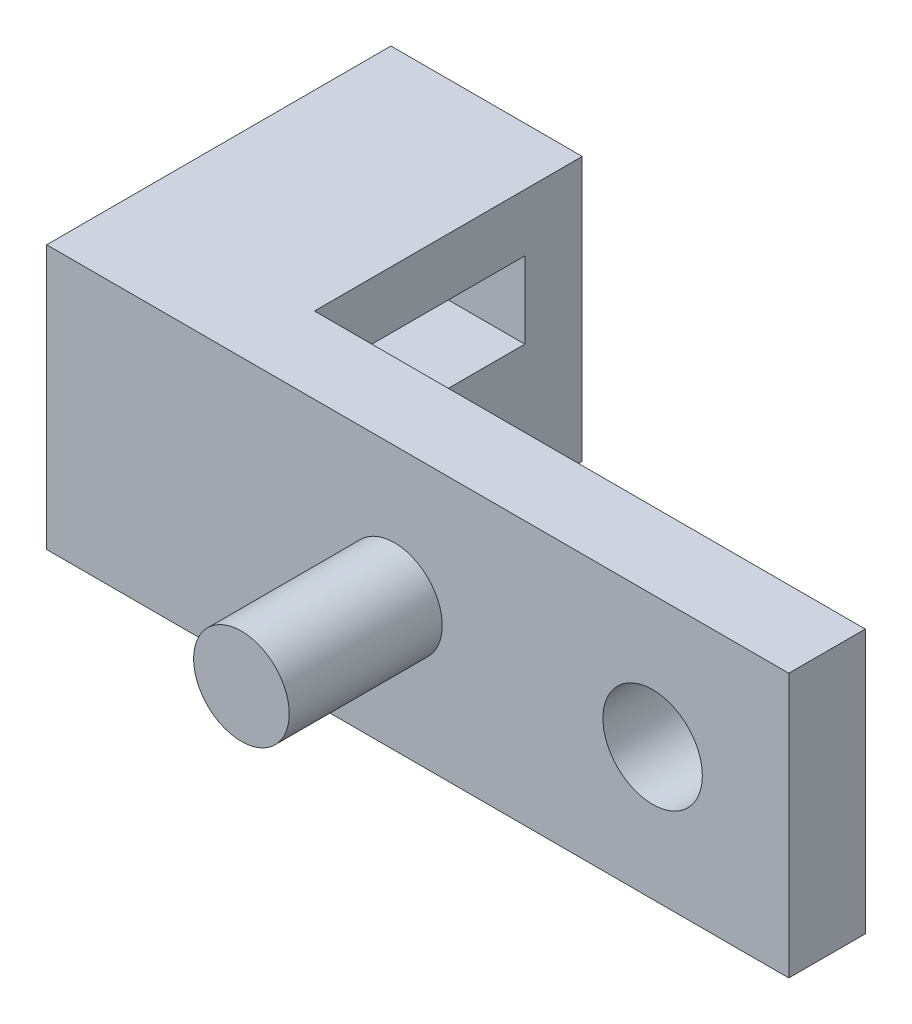
ISO-10303-21;
HEADER;
FILE_DESCRIPTION(('STEP AP214'),'2;1');
FILE_NAME('part.step','',(''),(''),'','','');
FILE_SCHEMA(('AUTOMOTIVE_DESIGN { 1 0 10303 214 1 1 1 1 }'));
ENDSEC;
DATA;
#1=APPLICATION_CONTEXT('core data for automotive mechanical design processes');
#2=APPLICATION_PROTOCOL_DEFINITION('international standard','automotive_design',2000,#1);
#3=PRODUCT_CONTEXT('',#1,'mechanical');
#4=PRODUCT('Part','Part','',(#3));
#5=PRODUCT_RELATED_PRODUCT_CATEGORY('part','',(#4));
#6=PRODUCT_DEFINITION_FORMATION('','',#4);
#7=PRODUCT_DEFINITION_CONTEXT('part definition',#1,'design');
#8=PRODUCT_DEFINITION('design','',#6,#7);
#9=PRODUCT_DEFINITION_SHAPE('','',#8);
#10=(LENGTH_UNIT() NAMED_UNIT(*) SI_UNIT(.MILLI.,.METRE.));
#11=(NAMED_UNIT(*) PLANE_ANGLE_UNIT() SI_UNIT($,.RADIAN.));
#12=(NAMED_UNIT(*) SI_UNIT($,.STERADIAN.) SOLID_ANGLE_UNIT());
#13=UNCERTAINTY_MEASURE_WITH_UNIT(LENGTH_MEASURE(1.E-05),#10,'distance_accuracy_value','');
#14=(GEOMETRIC_REPRESENTATION_CONTEXT(3) GLOBAL_UNCERTAINTY_ASSIGNED_CONTEXT((#13)) GLOBAL_UNIT_ASSIGNED_CONTEXT((#10,
#11,#12)) REPRESENTATION_CONTEXT('',''));
#15=CARTESIAN_POINT('',(0.,0.,0.));
#16=DIRECTION('',(0.,0.,1.));
#17=DIRECTION('',(1.,0.,0.));
#18=AXIS2_PLACEMENT_3D('',#15,#16,#17);
#19=CARTESIAN_POINT('',(154.749006663672,6.9,21.0054991539763));
#20=DIRECTION('',(0.,0.,-1.));
#21=DIRECTION('',(-1.,0.,0.));
#22=AXIS2_PLACEMENT_3D('',#19,#20,#21);
#23=PLANE('',#22);
#24=DIRECTION('',(1.,0.,0.));
#25=VECTOR('',#24,1.);
#26=CARTESIAN_POINT('',(154.749006663672,0.,21.0054991539763));
#27=LINE('',#26,#25);
#28=CARTESIAN_POINT('',(135.349006663672,0.,21.0054991539763));
#29=VERTEX_POINT('',#28);
#30=CARTESIAN_POINT('',(154.749006663672,0.,21.0054991539763));
#31=VERTEX_POINT('',#30);
#32=EDGE_CURVE('E160',#29,#31,#27,.T.);
#33=ORIENTED_EDGE('',*,*,#32,.T.);
#34=DIRECTION('',(0.,-1.,0.));
#35=VECTOR('',#34,1.);
#36=CARTESIAN_POINT('',(154.749006663672,6.9,21.0054991539763));
#37=LINE('',#36,#35);
#38=CARTESIAN_POINT('',(154.749006663672,6.9,21.0054991539763));
#39=VERTEX_POINT('',#38);
#40=EDGE_CURVE('E170',#39,#31,#37,.T.);
#41=ORIENTED_EDGE('',*,*,#40,.F.);
#42=DIRECTION('',(1.,0.,0.));
#43=VECTOR('',#42,1.);
#44=CARTESIAN_POINT('',(154.749006663672,6.9,21.0054991539763));
#45=LINE('',#44,#43);
#46=CARTESIAN_POINT('',(135.349006663672,6.9,21.0054991539763));
#47=VERTEX_POINT('',#46);
#48=EDGE_CURVE('E168',#47,#39,#45,.T.);
#49=ORIENTED_EDGE('',*,*,#48,.F.);
#50=DIRECTION('',(0.,-1.,0.));
#51=VECTOR('',#50,1.);
#52=CARTESIAN_POINT('',(135.349006663672,6.9,21.0054991539763));
#53=LINE('',#52,#51);
#54=EDGE_CURVE('E184',#47,#29,#53,.T.);
#55=ORIENTED_EDGE('',*,*,#54,.T.);
#56=EDGE_LOOP('',(#33,#41,#49,#55));
#57=FACE_BOUND('',#56,.T.);
#58=CARTESIAN_POINT('',(151.189006663672,3.45,21.0054991539764));
#59=DIRECTION('',(0.,0.,1.));
#60=DIRECTION('',(1.,0.,0.));
#61=AXIS2_PLACEMENT_3D('',#58,#59,#60);
#62=CIRCLE('',#61,1.30000000000001);
#63=CARTESIAN_POINT('',(152.489006663672,3.45,21.0054991539764));
#64=VERTEX_POINT('',#63);
#65=EDGE_CURVE('E149',#64,#64,#62,.T.);
#66=ORIENTED_EDGE('',*,*,#65,.F.);
#67=EDGE_LOOP('',(#66));
#68=FACE_BOUND('',#67,.T.);
#69=CARTESIAN_POINT('',(144.439006663672,3.45,21.0054991539763));
#70=DIRECTION('',(0.,0.,-1.));
#71=DIRECTION('',(-1.,0.,0.));
#72=AXIS2_PLACEMENT_3D('',#69,#70,#71);
#73=CIRCLE('',#72,1.25000000000001);
#74=CARTESIAN_POINT('',(143.189006663672,3.45,21.0054991539763));
#75=VERTEX_POINT('',#74);
#76=EDGE_CURVE('E11',#75,#75,#73,.F.);
#77=ORIENTED_EDGE('',*,*,#76,.F.);
#78=EDGE_LOOP('',(#77));
#79=FACE_BOUND('',#78,.T.);
#80=ADVANCED_FACE('F33',(#57,#68,#79),#23,.F.);
#81=CARTESIAN_POINT('',(154.749006663672,6.9,19.0054991539763));
#82=DIRECTION('',(-1.,0.,0.));
#83=DIRECTION('',(0.,0.,1.));
#84=AXIS2_PLACEMENT_3D('',#81,#82,#83);
#85=PLANE('',#84);
#86=DIRECTION('',(0.,0.,-1.));
#87=VECTOR('',#86,1.);
#88=CARTESIAN_POINT('',(154.749006663672,0.,19.0054991539763));
#89=LINE('',#88,#87);
#90=CARTESIAN_POINT('',(154.749006663672,0.,19.0054991539763));
#91=VERTEX_POINT('',#90);
#92=EDGE_CURVE('E155',#31,#91,#89,.T.);
#93=ORIENTED_EDGE('',*,*,#92,.T.);
#94=DIRECTION('',(0.,-1.,0.));
#95=VECTOR('',#94,1.);
#96=CARTESIAN_POINT('',(154.749006663672,6.9,19.0054991539763));
#97=LINE('',#96,#95);
#98=CARTESIAN_POINT('',(154.749006663672,6.9,19.0054991539763));
#99=VERTEX_POINT('',#98);
#100=EDGE_CURVE('E41',#99,#91,#97,.T.);
#101=ORIENTED_EDGE('',*,*,#100,.F.);
#102=DIRECTION('',(0.,0.,-1.));
#103=VECTOR('',#102,1.);
#104=CARTESIAN_POINT('',(154.749006663672,6.9,19.0054991539763));
#105=LINE('',#104,#103);
#106=EDGE_CURVE('E156',#39,#99,#105,.T.);
#107=ORIENTED_EDGE('',*,*,#106,.F.);
#108=ORIENTED_EDGE('',*,*,#40,.T.);
#109=EDGE_LOOP('',(#93,#101,#107,#108));
#110=FACE_BOUND('',#109,.T.);
#111=ADVANCED_FACE('F35',(#110),#85,.F.);
#112=CARTESIAN_POINT('',(140.349006663672,6.9,19.0054991539763));
#113=DIRECTION('',(0.,0.,1.));
#114=DIRECTION('',(1.,0.,0.));
#115=AXIS2_PLACEMENT_3D('',#112,#113,#114);
#116=PLANE('',#115);
#117=CARTESIAN_POINT('',(151.189006663672,3.45,19.0054991539763));
#118=DIRECTION('',(0.,0.,1.));
#119=DIRECTION('',(1.,0.,0.));
#120=AXIS2_PLACEMENT_3D('',#117,#118,#119);
#121=CIRCLE('',#120,1.30000000000001);
#122=CARTESIAN_POINT('',(152.489006663672,3.45,19.0054991539763));
#123=VERTEX_POINT('',#122);
#124=EDGE_CURVE('E152',#123,#123,#121,.T.);
#125=ORIENTED_EDGE('',*,*,#124,.T.);
#126=EDGE_LOOP('',(#125));
#127=FACE_BOUND('',#126,.T.);
#128=DIRECTION('',(-1.,0.,0.));
#129=VECTOR('',#128,1.);
#130=CARTESIAN_POINT('',(140.349006663672,0.,19.0054991539763));
#131=LINE('',#130,#129);
#132=CARTESIAN_POINT('',(140.349006663672,0.,19.0054991539763));
#133=VERTEX_POINT('',#132);
#134=EDGE_CURVE('E173',#91,#133,#131,.T.);
#135=ORIENTED_EDGE('',*,*,#134,.T.);
#136=DIRECTION('',(0.,-1.,0.));
#137=VECTOR('',#136,1.);
#138=CARTESIAN_POINT('',(140.349006663672,6.9,19.0054991539763));
#139=LINE('',#138,#137);
#140=CARTESIAN_POINT('',(140.349006663672,6.9,19.0054991539763));
#141=VERTEX_POINT('',#140);
#142=EDGE_CURVE('E193',#141,#133,#139,.T.);
#143=ORIENTED_EDGE('',*,*,#142,.F.);
#144=DIRECTION('',(-1.,0.,0.));
#145=VECTOR('',#144,1.);
#146=CARTESIAN_POINT('',(140.349006663672,6.9,19.0054991539763));
#147=LINE('',#146,#145);
#148=EDGE_CURVE('E159',#99,#141,#147,.T.);
#149=ORIENTED_EDGE('',*,*,#148,.F.);
#150=ORIENTED_EDGE('',*,*,#100,.T.);
#151=EDGE_LOOP('',(#135,#143,#149,#150));
#152=FACE_BOUND('',#151,.T.);
#153=ADVANCED_FACE('F198',(#127,#152),#116,.F.);
#154=CARTESIAN_POINT('',(140.349006663672,6.9,12.0054991539763));
#155=DIRECTION('',(-1.,0.,0.));
#156=DIRECTION('',(0.,0.,1.));
#157=AXIS2_PLACEMENT_3D('',#154,#155,#156);
#158=PLANE('',#157);
#159=DIRECTION('',(0.,0.,-1.));
#160=VECTOR('',#159,1.);
#161=CARTESIAN_POINT('',(140.349006663672,3.4,17.5054991539763));
#162=LINE('',#161,#160);
#163=CARTESIAN_POINT('',(140.349006663672,3.4,17.5054991539763));
#164=VERTEX_POINT('',#163);
#165=CARTESIAN_POINT('',(140.349006663672,3.4,13.5054991539763));
#166=VERTEX_POINT('',#165);
#167=EDGE_CURVE('E137',#164,#166,#162,.T.);
#168=ORIENTED_EDGE('',*,*,#167,.F.);
#169=DIRECTION('',(0.,-1.,0.));
#170=VECTOR('',#169,1.);
#171=CARTESIAN_POINT('',(140.349006663672,3.4,17.5054991539763));
#172=LINE('',#171,#170);
#173=CARTESIAN_POINT('',(140.349006663672,5.4,17.5054991539763));
#174=VERTEX_POINT('',#173);
#175=EDGE_CURVE('E48',#174,#164,#172,.T.);
#176=ORIENTED_EDGE('',*,*,#175,.F.);
#177=DIRECTION('',(0.,0.,1.));
#178=VECTOR('',#177,1.);
#179=CARTESIAN_POINT('',(140.349006663672,5.4,17.5054991539763));
#180=LINE('',#179,#178);
#181=CARTESIAN_POINT('',(140.349006663672,5.4,13.5054991539763));
#182=VERTEX_POINT('',#181);
#183=EDGE_CURVE('E128',#182,#174,#180,.T.);
#184=ORIENTED_EDGE('',*,*,#183,.F.);
#185=DIRECTION('',(0.,1.,0.));
#186=VECTOR('',#185,1.);
#187=CARTESIAN_POINT('',(140.349006663672,3.4,13.5054991539763));
#188=LINE('',#187,#186);
#189=EDGE_CURVE('E131',#166,#182,#188,.T.);
#190=ORIENTED_EDGE('',*,*,#189,.F.);
#191=EDGE_LOOP('',(#168,#176,#184,#190));
#192=FACE_BOUND('',#191,.T.);
#193=DIRECTION('',(0.,0.,-1.));
#194=VECTOR('',#193,1.);
#195=CARTESIAN_POINT('',(140.349006663672,0.,12.0054991539763));
#196=LINE('',#195,#194);
#197=CARTESIAN_POINT('',(140.349006663672,0.,12.0054991539763));
#198=VERTEX_POINT('',#197);
#199=EDGE_CURVE('E175',#133,#198,#196,.T.);
#200=ORIENTED_EDGE('',*,*,#199,.T.);
#201=DIRECTION('',(0.,-1.,0.));
#202=VECTOR('',#201,1.);
#203=CARTESIAN_POINT('',(140.349006663672,6.9,12.0054991539763));
#204=LINE('',#203,#202);
#205=CARTESIAN_POINT('',(140.349006663672,6.9,12.0054991539763));
#206=VERTEX_POINT('',#205);
#207=EDGE_CURVE('E190',#206,#198,#204,.T.);
#208=ORIENTED_EDGE('',*,*,#207,.F.);
#209=DIRECTION('',(0.,0.,-1.));
#210=VECTOR('',#209,1.);
#211=CARTESIAN_POINT('',(140.349006663672,6.9,12.0054991539763));
#212=LINE('',#211,#210);
#213=EDGE_CURVE('E162',#141,#206,#212,.T.);
#214=ORIENTED_EDGE('',*,*,#213,.F.);
#215=ORIENTED_EDGE('',*,*,#142,.T.);
#216=EDGE_LOOP('',(#200,#208,#214,#215));
#217=FACE_BOUND('',#216,.T.);
#218=ADVANCED_FACE('F212',(#192,#217),#158,.F.);
#219=CARTESIAN_POINT('',(135.349006663672,6.9,12.0054991539763));
#220=DIRECTION('',(0.,0.,1.));
#221=DIRECTION('',(1.,0.,0.));
#222=AXIS2_PLACEMENT_3D('',#219,#220,#221);
#223=PLANE('',#222);
#224=DIRECTION('',(-1.,0.,0.));
#225=VECTOR('',#224,1.);
#226=CARTESIAN_POINT('',(135.349006663672,0.,12.0054991539763));
#227=LINE('',#226,#225);
#228=CARTESIAN_POINT('',(135.349006663672,0.,12.0054991539763));
#229=VERTEX_POINT('',#228);
#230=EDGE_CURVE('E177',#198,#229,#227,.T.);
#231=ORIENTED_EDGE('',*,*,#230,.T.);
#232=DIRECTION('',(0.,-1.,0.));
#233=VECTOR('',#232,1.);
#234=CARTESIAN_POINT('',(135.349006663672,6.9,12.0054991539763));
#235=LINE('',#234,#233);
#236=CARTESIAN_POINT('',(135.349006663672,6.9,12.0054991539763));
#237=VERTEX_POINT('',#236);
#238=EDGE_CURVE('E187',#237,#229,#235,.T.);
#239=ORIENTED_EDGE('',*,*,#238,.F.);
#240=DIRECTION('',(-1.,0.,0.));
#241=VECTOR('',#240,1.);
#242=CARTESIAN_POINT('',(135.349006663672,6.9,12.0054991539763));
#243=LINE('',#242,#241);
#244=EDGE_CURVE('E164',#206,#237,#243,.T.);
#245=ORIENTED_EDGE('',*,*,#244,.F.);
#246=ORIENTED_EDGE('',*,*,#207,.T.);
#247=EDGE_LOOP('',(#231,#239,#245,#246));
#248=FACE_BOUND('',#247,.T.);
#249=ADVANCED_FACE('F216',(#248),#223,.F.);
#250=CARTESIAN_POINT('',(135.349006663672,6.9,21.0054991539763));
#251=DIRECTION('',(1.,0.,0.));
#252=DIRECTION('',(0.,0.,-1.));
#253=AXIS2_PLACEMENT_3D('',#250,#251,#252);
#254=PLANE('',#253);
#255=DIRECTION('',(0.,0.,1.));
#256=VECTOR('',#255,1.);
#257=CARTESIAN_POINT('',(135.349006663672,5.4,17.5054991539763));
#258=LINE('',#257,#256);
#259=CARTESIAN_POINT('',(135.349006663672,5.4,13.5054991539763));
#260=VERTEX_POINT('',#259);
#261=CARTESIAN_POINT('',(135.349006663672,5.4,17.5054991539763));
#262=VERTEX_POINT('',#261);
#263=EDGE_CURVE('E118',#260,#262,#258,.T.);
#264=ORIENTED_EDGE('',*,*,#263,.T.);
#265=DIRECTION('',(0.,-1.,0.));
#266=VECTOR('',#265,1.);
#267=CARTESIAN_POINT('',(135.349006663672,3.4,17.5054991539763));
#268=LINE('',#267,#266);
#269=CARTESIAN_POINT('',(135.349006663672,3.4,17.5054991539763));
#270=VERTEX_POINT('',#269);
#271=EDGE_CURVE('E112',#262,#270,#268,.T.);
#272=ORIENTED_EDGE('',*,*,#271,.T.);
#273=DIRECTION('',(0.,0.,-1.));
#274=VECTOR('',#273,1.);
#275=CARTESIAN_POINT('',(135.349006663672,3.4,17.5054991539763));
#276=LINE('',#275,#274);
#277=CARTESIAN_POINT('',(135.349006663672,3.4,13.5054991539763));
#278=VERTEX_POINT('',#277);
#279=EDGE_CURVE('E121',#270,#278,#276,.T.);
#280=ORIENTED_EDGE('',*,*,#279,.T.);
#281=DIRECTION('',(0.,1.,0.));
#282=VECTOR('',#281,1.);
#283=CARTESIAN_POINT('',(135.349006663672,3.4,13.5054991539763));
#284=LINE('',#283,#282);
#285=EDGE_CURVE('E56',#278,#260,#284,.T.);
#286=ORIENTED_EDGE('',*,*,#285,.T.);
#287=EDGE_LOOP('',(#264,#272,#280,#286));
#288=FACE_BOUND('',#287,.T.);
#289=DIRECTION('',(0.,0.,1.));
#290=VECTOR('',#289,1.);
#291=CARTESIAN_POINT('',(135.349006663672,0.,21.0054991539763));
#292=LINE('',#291,#290);
#293=EDGE_CURVE('E179',#229,#29,#292,.T.);
#294=ORIENTED_EDGE('',*,*,#293,.T.);
#295=ORIENTED_EDGE('',*,*,#54,.F.);
#296=DIRECTION('',(0.,0.,1.));
#297=VECTOR('',#296,1.);
#298=CARTESIAN_POINT('',(135.349006663672,6.9,21.0054991539763));
#299=LINE('',#298,#297);
#300=EDGE_CURVE('E166',#237,#47,#299,.T.);
#301=ORIENTED_EDGE('',*,*,#300,.F.);
#302=ORIENTED_EDGE('',*,*,#238,.T.);
#303=EDGE_LOOP('',(#294,#295,#301,#302));
#304=FACE_BOUND('',#303,.T.);
#305=ADVANCED_FACE('F125',(#288,#304),#254,.F.);
#306=CARTESIAN_POINT('',(0.,6.9,0.));
#307=DIRECTION('',(0.,-1.,0.));
#308=DIRECTION('',(0.,0.,-1.));
#309=AXIS2_PLACEMENT_3D('',#306,#307,#308);
#310=PLANE('',#309);
#311=ORIENTED_EDGE('',*,*,#106,.T.);
#312=ORIENTED_EDGE('',*,*,#148,.T.);
#313=ORIENTED_EDGE('',*,*,#213,.T.);
#314=ORIENTED_EDGE('',*,*,#244,.T.);
#315=ORIENTED_EDGE('',*,*,#300,.T.);
#316=ORIENTED_EDGE('',*,*,#48,.T.);
#317=EDGE_LOOP('',(#311,#312,#313,#314,#315,#316));
#318=FACE_BOUND('',#317,.T.);
#319=ADVANCED_FACE('F220',(#318),#310,.F.);
#320=CARTESIAN_POINT('',(0.,0.,0.));
#321=DIRECTION('',(0.,-1.,0.));
#322=DIRECTION('',(0.,0.,-1.));
#323=AXIS2_PLACEMENT_3D('',#320,#321,#322);
#324=PLANE('',#323);
#325=ORIENTED_EDGE('',*,*,#92,.F.);
#326=ORIENTED_EDGE('',*,*,#32,.F.);
#327=ORIENTED_EDGE('',*,*,#293,.F.);
#328=ORIENTED_EDGE('',*,*,#230,.F.);
#329=ORIENTED_EDGE('',*,*,#199,.F.);
#330=ORIENTED_EDGE('',*,*,#134,.F.);
#331=EDGE_LOOP('',(#325,#326,#327,#328,#329,#330));
#332=FACE_BOUND('',#331,.T.);
#333=ADVANCED_FACE('F206',(#332),#324,.T.);
#334=CARTESIAN_POINT('',(151.189006663672,3.45,12.0054991539763));
#335=DIRECTION('',(0.,0.,1.));
#336=DIRECTION('',(1.,0.,0.));
#337=AXIS2_PLACEMENT_3D('',#334,#335,#336);
#338=CYLINDRICAL_SURFACE('',#337,1.30000000000001);
#339=ORIENTED_EDGE('',*,*,#65,.T.);
#340=EDGE_LOOP('',(#339));
#341=FACE_BOUND('',#340,.T.);
#342=ORIENTED_EDGE('',*,*,#124,.F.);
#343=EDGE_LOOP('',(#342));
#344=FACE_BOUND('',#343,.T.);
#345=ADVANCED_FACE('F240',(#341,#344),#338,.F.);
#346=CARTESIAN_POINT('',(144.439006663672,3.45,25.0054991539764));
#347=DIRECTION('',(0.,0.,-1.));
#348=DIRECTION('',(-1.,0.,0.));
#349=AXIS2_PLACEMENT_3D('',#346,#347,#348);
#350=CYLINDRICAL_SURFACE('',#349,1.25000000000001);
#351=CARTESIAN_POINT('',(144.439006663672,3.45,25.0054991539764));
#352=DIRECTION('',(0.,0.,1.));
#353=DIRECTION('',(1.,0.,0.));
#354=AXIS2_PLACEMENT_3D('',#351,#352,#353);
#355=CIRCLE('',#354,1.25000000000001);
#356=CARTESIAN_POINT('',(145.689006663672,3.45,25.0054991539764));
#357=VERTEX_POINT('',#356);
#358=EDGE_CURVE('E143',#357,#357,#355,.T.);
#359=ORIENTED_EDGE('',*,*,#358,.F.);
#360=EDGE_LOOP('',(#359));
#361=FACE_BOUND('',#360,.T.);
#362=ORIENTED_EDGE('',*,*,#76,.T.);
#363=EDGE_LOOP('',(#362));
#364=FACE_BOUND('',#363,.T.);
#365=ADVANCED_FACE('F244',(#361,#364),#350,.T.);
#366=CARTESIAN_POINT('',(144.439006663672,3.45,25.0054991539764));
#367=DIRECTION('',(0.,0.,1.));
#368=DIRECTION('',(1.,0.,0.));
#369=AXIS2_PLACEMENT_3D('',#366,#367,#368);
#370=PLANE('',#369);
#371=ORIENTED_EDGE('',*,*,#358,.T.);
#372=EDGE_LOOP('',(#371));
#373=FACE_BOUND('',#372,.T.);
#374=ADVANCED_FACE('F248',(#373),#370,.T.);
#375=CARTESIAN_POINT('',(135.349006663672,3.4,17.5054991539763));
#376=DIRECTION('',(0.,0.,1.));
#377=DIRECTION('',(1.,0.,0.));
#378=AXIS2_PLACEMENT_3D('',#375,#376,#377);
#379=PLANE('',#378);
#380=ORIENTED_EDGE('',*,*,#175,.T.);
#381=DIRECTION('',(1.,0.,0.));
#382=VECTOR('',#381,1.);
#383=CARTESIAN_POINT('',(135.349006663672,3.4,17.5054991539763));
#384=LINE('',#383,#382);
#385=EDGE_CURVE('E108',#270,#164,#384,.T.);
#386=ORIENTED_EDGE('',*,*,#385,.F.);
#387=ORIENTED_EDGE('',*,*,#271,.F.);
#388=DIRECTION('',(1.,0.,0.));
#389=VECTOR('',#388,1.);
#390=CARTESIAN_POINT('',(135.349006663672,5.4,17.5054991539763));
#391=LINE('',#390,#389);
#392=EDGE_CURVE('E141',#262,#174,#391,.T.);
#393=ORIENTED_EDGE('',*,*,#392,.T.);
#394=EDGE_LOOP('',(#380,#386,#387,#393));
#395=FACE_BOUND('',#394,.T.);
#396=ADVANCED_FACE('F110',(#395),#379,.F.);
#397=CARTESIAN_POINT('',(135.349006663672,5.4,17.5054991539763));
#398=DIRECTION('',(0.,1.,0.));
#399=DIRECTION('',(0.,0.,1.));
#400=AXIS2_PLACEMENT_3D('',#397,#398,#399);
#401=PLANE('',#400);
#402=ORIENTED_EDGE('',*,*,#183,.T.);
#403=ORIENTED_EDGE('',*,*,#392,.F.);
#404=ORIENTED_EDGE('',*,*,#263,.F.);
#405=DIRECTION('',(1.,0.,0.));
#406=VECTOR('',#405,1.);
#407=CARTESIAN_POINT('',(135.349006663672,5.4,13.5054991539763));
#408=LINE('',#407,#406);
#409=EDGE_CURVE('E144',#260,#182,#408,.T.);
#410=ORIENTED_EDGE('',*,*,#409,.T.);
#411=EDGE_LOOP('',(#402,#403,#404,#410));
#412=FACE_BOUND('',#411,.T.);
#413=ADVANCED_FACE('F255',(#412),#401,.F.);
#414=CARTESIAN_POINT('',(135.349006663672,3.4,13.5054991539763));
#415=DIRECTION('',(0.,0.,-1.));
#416=DIRECTION('',(-1.,0.,0.));
#417=AXIS2_PLACEMENT_3D('',#414,#415,#416);
#418=PLANE('',#417);
#419=ORIENTED_EDGE('',*,*,#189,.T.);
#420=ORIENTED_EDGE('',*,*,#409,.F.);
#421=ORIENTED_EDGE('',*,*,#285,.F.);
#422=DIRECTION('',(1.,0.,0.));
#423=VECTOR('',#422,1.);
#424=CARTESIAN_POINT('',(135.349006663672,3.4,13.5054991539763));
#425=LINE('',#424,#423);
#426=EDGE_CURVE('E117',#278,#166,#425,.T.);
#427=ORIENTED_EDGE('',*,*,#426,.T.);
#428=EDGE_LOOP('',(#419,#420,#421,#427));
#429=FACE_BOUND('',#428,.T.);
#430=ADVANCED_FACE('F258',(#429),#418,.F.);
#431=CARTESIAN_POINT('',(135.349006663672,3.4,17.5054991539763));
#432=DIRECTION('',(0.,-1.,0.));
#433=DIRECTION('',(0.,0.,-1.));
#434=AXIS2_PLACEMENT_3D('',#431,#432,#433);
#435=PLANE('',#434);
#436=ORIENTED_EDGE('',*,*,#167,.T.);
#437=ORIENTED_EDGE('',*,*,#426,.F.);
#438=ORIENTED_EDGE('',*,*,#279,.F.);
#439=ORIENTED_EDGE('',*,*,#385,.T.);
#440=EDGE_LOOP('',(#436,#437,#438,#439));
#441=FACE_BOUND('',#440,.T.);
#442=ADVANCED_FACE('F122',(#441),#435,.F.);
#443=CLOSED_SHELL('',(#80,#111,#153,#218,#249,#305,#319,#333,#345,#365,#374,#396,#413,#430,#442));
#444=MANIFOLD_SOLID_BREP('B2',#443);
#445=ADVANCED_BREP_SHAPE_REPRESENTATION('',(#18,#444),#14);
#446=SHAPE_DEFINITION_REPRESENTATION(#9,#445);
ENDSEC;
END-ISO-10303-21;
